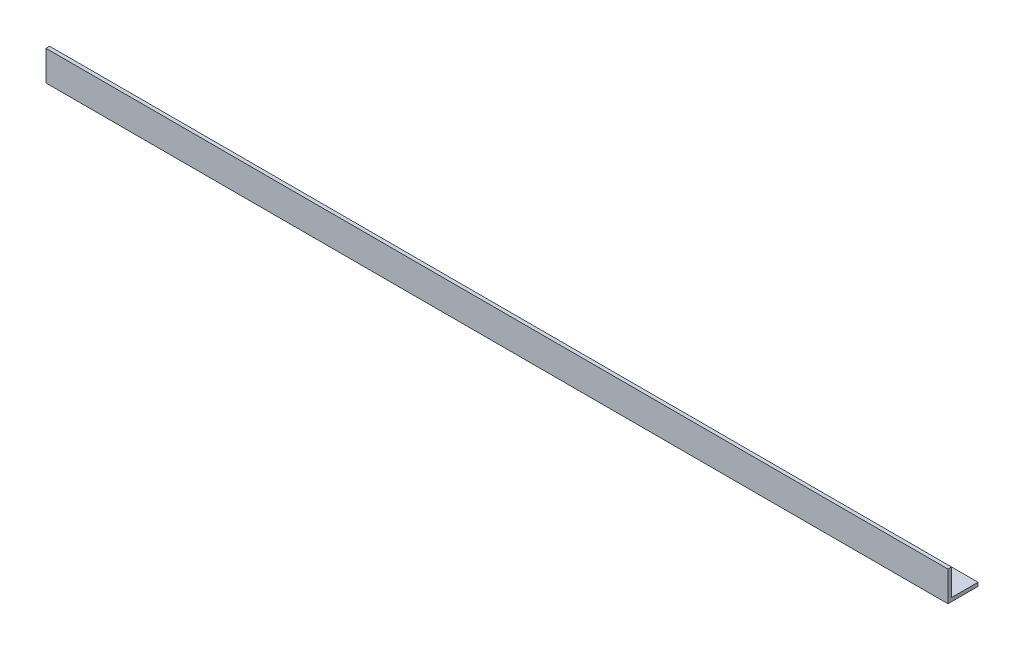
ISO-10303-21;
HEADER;
FILE_DESCRIPTION(('STEP AP214'),'2;1');
FILE_NAME('part.step','',(''),(''),'','','');
FILE_SCHEMA(('AUTOMOTIVE_DESIGN { 1 0 10303 214 1 1 1 1 }'));
ENDSEC;
DATA;
#1=APPLICATION_CONTEXT('core data for automotive mechanical design processes');
#2=APPLICATION_PROTOCOL_DEFINITION('international standard','automotive_design',2000,#1);
#3=PRODUCT_CONTEXT('',#1,'mechanical');
#4=PRODUCT('Part','Part','',(#3));
#5=PRODUCT_RELATED_PRODUCT_CATEGORY('part','',(#4));
#6=PRODUCT_DEFINITION_FORMATION('','',#4);
#7=PRODUCT_DEFINITION_CONTEXT('part definition',#1,'design');
#8=PRODUCT_DEFINITION('design','',#6,#7);
#9=PRODUCT_DEFINITION_SHAPE('','',#8);
#10=(LENGTH_UNIT() NAMED_UNIT(*) SI_UNIT(.MILLI.,.METRE.));
#11=(NAMED_UNIT(*) PLANE_ANGLE_UNIT() SI_UNIT($,.RADIAN.));
#12=(NAMED_UNIT(*) SI_UNIT($,.STERADIAN.) SOLID_ANGLE_UNIT());
#13=UNCERTAINTY_MEASURE_WITH_UNIT(LENGTH_MEASURE(1.E-05),#10,'distance_accuracy_value','');
#14=(GEOMETRIC_REPRESENTATION_CONTEXT(3) GLOBAL_UNCERTAINTY_ASSIGNED_CONTEXT((#13)) GLOBAL_UNIT_ASSIGNED_CONTEXT((#10,
#11,#12)) REPRESENTATION_CONTEXT('',''));
#15=CARTESIAN_POINT('',(0.,0.,0.));
#16=DIRECTION('',(0.,0.,1.));
#17=DIRECTION('',(1.,0.,0.));
#18=AXIS2_PLACEMENT_3D('',#15,#16,#17);
#19=CARTESIAN_POINT('',(1500.,0.,0.));
#20=DIRECTION('',(0.,1.,0.));
#21=DIRECTION('',(0.,0.,1.));
#22=AXIS2_PLACEMENT_3D('',#19,#20,#21);
#23=PLANE('',#22);
#24=DIRECTION('',(0.,0.,-1.));
#25=VECTOR('',#24,1.);
#26=CARTESIAN_POINT('',(0.,0.,0.));
#27=LINE('',#26,#25);
#28=CARTESIAN_POINT('',(0.,0.,0.));
#29=VERTEX_POINT('',#28);
#30=CARTESIAN_POINT('',(0.,0.,-50.));
#31=VERTEX_POINT('',#30);
#32=EDGE_CURVE('E115',#29,#31,#27,.T.);
#33=ORIENTED_EDGE('',*,*,#32,.T.);
#34=DIRECTION('',(-1.,0.,0.));
#35=VECTOR('',#34,1.);
#36=CARTESIAN_POINT('',(1500.,0.,-50.));
#37=LINE('',#36,#35);
#38=CARTESIAN_POINT('',(1500.,0.,-50.));
#39=VERTEX_POINT('',#38);
#40=EDGE_CURVE('E11',#39,#31,#37,.T.);
#41=ORIENTED_EDGE('',*,*,#40,.F.);
#42=DIRECTION('',(0.,0.,-1.));
#43=VECTOR('',#42,1.);
#44=CARTESIAN_POINT('',(1500.,0.,0.));
#45=LINE('',#44,#43);
#46=CARTESIAN_POINT('',(1500.,0.,0.));
#47=VERTEX_POINT('',#46);
#48=EDGE_CURVE('E80',#47,#39,#45,.T.);
#49=ORIENTED_EDGE('',*,*,#48,.F.);
#50=DIRECTION('',(-1.,0.,0.));
#51=VECTOR('',#50,1.);
#52=CARTESIAN_POINT('',(1500.,0.,0.));
#53=LINE('',#52,#51);
#54=EDGE_CURVE('E111',#47,#29,#53,.T.);
#55=ORIENTED_EDGE('',*,*,#54,.T.);
#56=EDGE_LOOP('',(#33,#41,#49,#55));
#57=FACE_BOUND('',#56,.T.);
#58=ADVANCED_FACE('F34',(#57),#23,.F.);
#59=CARTESIAN_POINT('',(1500.,6.,-50.));
#60=DIRECTION('',(0.,0.,-1.));
#61=DIRECTION('',(-1.,0.,0.));
#62=AXIS2_PLACEMENT_3D('',#59,#60,#61);
#63=PLANE('',#62);
#64=DIRECTION('',(0.,-1.,0.));
#65=VECTOR('',#64,1.);
#66=CARTESIAN_POINT('',(0.,6.,-50.));
#67=LINE('',#66,#65);
#68=CARTESIAN_POINT('',(0.,6.,-50.));
#69=VERTEX_POINT('',#68);
#70=EDGE_CURVE('E118',#69,#31,#67,.T.);
#71=ORIENTED_EDGE('',*,*,#70,.F.);
#72=DIRECTION('',(-1.,0.,0.));
#73=VECTOR('',#72,1.);
#74=CARTESIAN_POINT('',(1500.,6.,-50.));
#75=LINE('',#74,#73);
#76=CARTESIAN_POINT('',(1500.,6.,-50.));
#77=VERTEX_POINT('',#76);
#78=EDGE_CURVE('E42',#77,#69,#75,.T.);
#79=ORIENTED_EDGE('',*,*,#78,.F.);
#80=DIRECTION('',(0.,-1.,0.));
#81=VECTOR('',#80,1.);
#82=CARTESIAN_POINT('',(1500.,6.,-50.));
#83=LINE('',#82,#81);
#84=EDGE_CURVE('E204',#77,#39,#83,.T.);
#85=ORIENTED_EDGE('',*,*,#84,.T.);
#86=ORIENTED_EDGE('',*,*,#40,.T.);
#87=EDGE_LOOP('',(#71,#79,#85,#86));
#88=FACE_BOUND('',#87,.T.);
#89=ADVANCED_FACE('F136',(#88),#63,.T.);
#90=CARTESIAN_POINT('',(1500.,6.,0.));
#91=DIRECTION('',(0.,1.,0.));
#92=DIRECTION('',(0.,0.,1.));
#93=AXIS2_PLACEMENT_3D('',#90,#91,#92);
#94=PLANE('',#93);
#95=DIRECTION('',(0.,0.,-1.));
#96=VECTOR('',#95,1.);
#97=CARTESIAN_POINT('',(0.,6.,0.));
#98=LINE('',#97,#96);
#99=CARTESIAN_POINT('',(0.,6.,-6.));
#100=VERTEX_POINT('',#99);
#101=EDGE_CURVE('E121',#100,#69,#98,.T.);
#102=ORIENTED_EDGE('',*,*,#101,.F.);
#103=DIRECTION('',(-1.,0.,0.));
#104=VECTOR('',#103,1.);
#105=CARTESIAN_POINT('',(1500.,6.,-6.));
#106=LINE('',#105,#104);
#107=CARTESIAN_POINT('',(1500.,6.,-6.));
#108=VERTEX_POINT('',#107);
#109=EDGE_CURVE('E101',#108,#100,#106,.T.);
#110=ORIENTED_EDGE('',*,*,#109,.F.);
#111=DIRECTION('',(0.,0.,-1.));
#112=VECTOR('',#111,1.);
#113=CARTESIAN_POINT('',(1500.,6.,0.));
#114=LINE('',#113,#112);
#115=EDGE_CURVE('E107',#108,#77,#114,.T.);
#116=ORIENTED_EDGE('',*,*,#115,.T.);
#117=ORIENTED_EDGE('',*,*,#78,.T.);
#118=EDGE_LOOP('',(#102,#110,#116,#117));
#119=FACE_BOUND('',#118,.T.);
#120=ADVANCED_FACE('F133',(#119),#94,.T.);
#121=CARTESIAN_POINT('',(1500.,50.,-6.));
#122=DIRECTION('',(0.,0.,-1.));
#123=DIRECTION('',(-1.,0.,0.));
#124=AXIS2_PLACEMENT_3D('',#121,#122,#123);
#125=PLANE('',#124);
#126=DIRECTION('',(0.,1.,0.));
#127=VECTOR('',#126,1.);
#128=CARTESIAN_POINT('',(0.,50.,-6.));
#129=LINE('',#128,#127);
#130=CARTESIAN_POINT('',(0.,50.,-6.));
#131=VERTEX_POINT('',#130);
#132=EDGE_CURVE('E96',#131,#100,#129,.F.);
#133=ORIENTED_EDGE('',*,*,#132,.F.);
#134=DIRECTION('',(-1.,0.,0.));
#135=VECTOR('',#134,1.);
#136=CARTESIAN_POINT('',(1500.,50.,-6.));
#137=LINE('',#136,#135);
#138=CARTESIAN_POINT('',(1500.,50.,-6.));
#139=VERTEX_POINT('',#138);
#140=EDGE_CURVE('E91',#139,#131,#137,.T.);
#141=ORIENTED_EDGE('',*,*,#140,.F.);
#142=DIRECTION('',(0.,1.,0.));
#143=VECTOR('',#142,1.);
#144=CARTESIAN_POINT('',(1500.,50.,-6.));
#145=LINE('',#144,#143);
#146=EDGE_CURVE('E94',#139,#108,#145,.F.);
#147=ORIENTED_EDGE('',*,*,#146,.T.);
#148=ORIENTED_EDGE('',*,*,#109,.T.);
#149=EDGE_LOOP('',(#133,#141,#147,#148));
#150=FACE_BOUND('',#149,.T.);
#151=ADVANCED_FACE('F93',(#150),#125,.T.);
#152=CARTESIAN_POINT('',(1500.,50.,0.));
#153=DIRECTION('',(0.,1.,0.));
#154=DIRECTION('',(0.,0.,1.));
#155=AXIS2_PLACEMENT_3D('',#152,#153,#154);
#156=PLANE('',#155);
#157=DIRECTION('',(0.,0.,-1.));
#158=VECTOR('',#157,1.);
#159=CARTESIAN_POINT('',(0.,50.,0.));
#160=LINE('',#159,#158);
#161=CARTESIAN_POINT('',(0.,50.,0.));
#162=VERTEX_POINT('',#161);
#163=EDGE_CURVE('E125',#162,#131,#160,.T.);
#164=ORIENTED_EDGE('',*,*,#163,.F.);
#165=DIRECTION('',(-1.,0.,0.));
#166=VECTOR('',#165,1.);
#167=CARTESIAN_POINT('',(1500.,50.,0.));
#168=LINE('',#167,#166);
#169=CARTESIAN_POINT('',(1500.,50.,0.));
#170=VERTEX_POINT('',#169);
#171=EDGE_CURVE('E71',#170,#162,#168,.T.);
#172=ORIENTED_EDGE('',*,*,#171,.F.);
#173=DIRECTION('',(0.,0.,-1.));
#174=VECTOR('',#173,1.);
#175=CARTESIAN_POINT('',(1500.,50.,0.));
#176=LINE('',#175,#174);
#177=EDGE_CURVE('E105',#170,#139,#176,.T.);
#178=ORIENTED_EDGE('',*,*,#177,.T.);
#179=ORIENTED_EDGE('',*,*,#140,.T.);
#180=EDGE_LOOP('',(#164,#172,#178,#179));
#181=FACE_BOUND('',#180,.T.);
#182=ADVANCED_FACE('F109',(#181),#156,.T.);
#183=CARTESIAN_POINT('',(1500.,50.,0.));
#184=DIRECTION('',(0.,0.,-1.));
#185=DIRECTION('',(-1.,0.,0.));
#186=AXIS2_PLACEMENT_3D('',#183,#184,#185);
#187=PLANE('',#186);
#188=DIRECTION('',(0.,-1.,0.));
#189=VECTOR('',#188,1.);
#190=CARTESIAN_POINT('',(0.,50.,0.));
#191=LINE('',#190,#189);
#192=EDGE_CURVE('E74',#162,#29,#191,.T.);
#193=ORIENTED_EDGE('',*,*,#192,.T.);
#194=ORIENTED_EDGE('',*,*,#54,.F.);
#195=DIRECTION('',(0.,-1.,0.));
#196=VECTOR('',#195,1.);
#197=CARTESIAN_POINT('',(1500.,50.,0.));
#198=LINE('',#197,#196);
#199=EDGE_CURVE('E50',#170,#47,#198,.T.);
#200=ORIENTED_EDGE('',*,*,#199,.F.);
#201=ORIENTED_EDGE('',*,*,#171,.T.);
#202=EDGE_LOOP('',(#193,#194,#200,#201));
#203=FACE_BOUND('',#202,.T.);
#204=ADVANCED_FACE('F141',(#203),#187,.F.);
#205=CARTESIAN_POINT('',(1500.,0.,0.));
#206=DIRECTION('',(-1.,0.,0.));
#207=DIRECTION('',(0.,0.,1.));
#208=AXIS2_PLACEMENT_3D('',#205,#206,#207);
#209=PLANE('',#208);
#210=ORIENTED_EDGE('',*,*,#48,.T.);
#211=ORIENTED_EDGE('',*,*,#84,.F.);
#212=ORIENTED_EDGE('',*,*,#115,.F.);
#213=ORIENTED_EDGE('',*,*,#146,.F.);
#214=ORIENTED_EDGE('',*,*,#177,.F.);
#215=ORIENTED_EDGE('',*,*,#199,.T.);
#216=EDGE_LOOP('',(#210,#211,#212,#213,#214,#215));
#217=FACE_BOUND('',#216,.T.);
#218=ADVANCED_FACE('F104',(#217),#209,.F.);
#219=CARTESIAN_POINT('',(0.,0.,0.));
#220=DIRECTION('',(-1.,0.,0.));
#221=DIRECTION('',(0.,0.,1.));
#222=AXIS2_PLACEMENT_3D('',#219,#220,#221);
#223=PLANE('',#222);
#224=ORIENTED_EDGE('',*,*,#32,.F.);
#225=ORIENTED_EDGE('',*,*,#192,.F.);
#226=ORIENTED_EDGE('',*,*,#163,.T.);
#227=ORIENTED_EDGE('',*,*,#132,.T.);
#228=ORIENTED_EDGE('',*,*,#101,.T.);
#229=ORIENTED_EDGE('',*,*,#70,.T.);
#230=EDGE_LOOP('',(#224,#225,#226,#227,#228,#229));
#231=FACE_BOUND('',#230,.T.);
#232=ADVANCED_FACE('F139',(#231),#223,.T.);
#233=CLOSED_SHELL('',(#58,#89,#120,#151,#182,#204,#218,#232));
#234=MANIFOLD_SOLID_BREP('B2',#233);
#235=ADVANCED_BREP_SHAPE_REPRESENTATION('',(#18,#234),#14);
#236=SHAPE_DEFINITION_REPRESENTATION(#9,#235);
ENDSEC;
END-ISO-10303-21;
